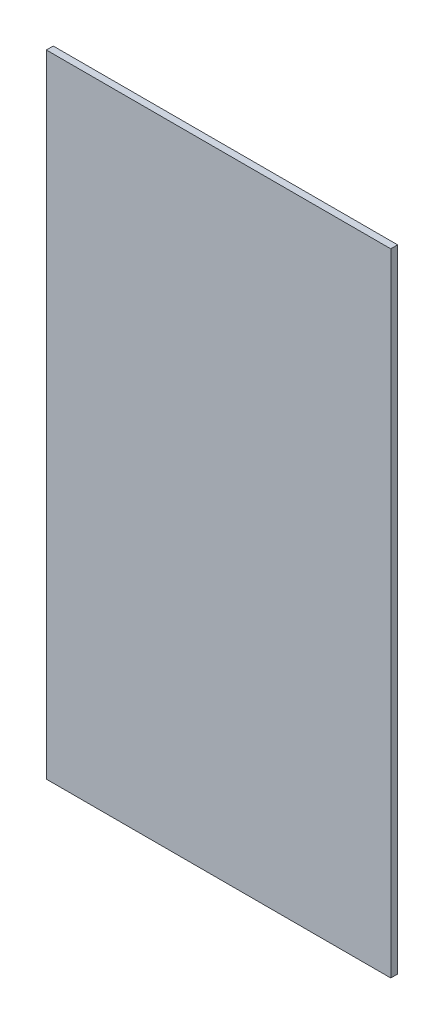
ISO-10303-21;
HEADER;
FILE_DESCRIPTION(('STEP AP214'),'2;1');
FILE_NAME('part.step','',(''),(''),'','','');
FILE_SCHEMA(('AUTOMOTIVE_DESIGN { 1 0 10303 214 1 1 1 1 }'));
ENDSEC;
DATA;
#1=APPLICATION_CONTEXT('core data for automotive mechanical design processes');
#2=APPLICATION_PROTOCOL_DEFINITION('international standard','automotive_design',2000,#1);
#3=PRODUCT_CONTEXT('',#1,'mechanical');
#4=PRODUCT('Part','Part','',(#3));
#5=PRODUCT_RELATED_PRODUCT_CATEGORY('part','',(#4));
#6=PRODUCT_DEFINITION_FORMATION('','',#4);
#7=PRODUCT_DEFINITION_CONTEXT('part definition',#1,'design');
#8=PRODUCT_DEFINITION('design','',#6,#7);
#9=PRODUCT_DEFINITION_SHAPE('','',#8);
#10=(LENGTH_UNIT() NAMED_UNIT(*) SI_UNIT(.MILLI.,.METRE.));
#11=(NAMED_UNIT(*) PLANE_ANGLE_UNIT() SI_UNIT($,.RADIAN.));
#12=(NAMED_UNIT(*) SI_UNIT($,.STERADIAN.) SOLID_ANGLE_UNIT());
#13=UNCERTAINTY_MEASURE_WITH_UNIT(LENGTH_MEASURE(1.E-05),#10,'distance_accuracy_value','');
#14=(GEOMETRIC_REPRESENTATION_CONTEXT(3) GLOBAL_UNCERTAINTY_ASSIGNED_CONTEXT((#13)) GLOBAL_UNIT_ASSIGNED_CONTEXT((#10,
#11,#12)) REPRESENTATION_CONTEXT('',''));
#15=CARTESIAN_POINT('',(0.,0.,0.));
#16=DIRECTION('',(0.,0.,1.));
#17=DIRECTION('',(1.,0.,0.));
#18=AXIS2_PLACEMENT_3D('',#15,#16,#17);
#19=CARTESIAN_POINT('',(0.5,0.,0.));
#20=DIRECTION('',(0.,0.,1.));
#21=DIRECTION('',(1.,0.,0.));
#22=AXIS2_PLACEMENT_3D('',#19,#20,#21);
#23=PLANE('',#22);
#24=DIRECTION('',(1.,0.,0.));
#25=VECTOR('',#24,1.);
#26=CARTESIAN_POINT('',(3.,4.584,0.));
#27=LINE('',#26,#25);
#28=CARTESIAN_POINT('',(3.,4.584,0.));
#29=VERTEX_POINT('',#28);
#30=CARTESIAN_POINT('',(-2.,4.584,0.));
#31=VERTEX_POINT('',#30);
#32=EDGE_CURVE('E79',#29,#31,#27,.F.);
#33=ORIENTED_EDGE('',*,*,#32,.F.);
#34=DIRECTION('',(0.,1.,0.));
#35=VECTOR('',#34,1.);
#36=CARTESIAN_POINT('',(3.,-4.584,0.));
#37=LINE('',#36,#35);
#38=CARTESIAN_POINT('',(3.,-4.584,0.));
#39=VERTEX_POINT('',#38);
#40=EDGE_CURVE('E55',#39,#29,#37,.T.);
#41=ORIENTED_EDGE('',*,*,#40,.F.);
#42=DIRECTION('',(1.,0.,0.));
#43=VECTOR('',#42,1.);
#44=CARTESIAN_POINT('',(-2.,-4.584,0.));
#45=LINE('',#44,#43);
#46=CARTESIAN_POINT('',(-2.,-4.584,0.));
#47=VERTEX_POINT('',#46);
#48=EDGE_CURVE('E57',#47,#39,#45,.T.);
#49=ORIENTED_EDGE('',*,*,#48,.F.);
#50=DIRECTION('',(0.,-1.,0.));
#51=VECTOR('',#50,1.);
#52=CARTESIAN_POINT('',(-2.,4.584,0.));
#53=LINE('',#52,#51);
#54=EDGE_CURVE('E20',#31,#47,#53,.T.);
#55=ORIENTED_EDGE('',*,*,#54,.F.);
#56=EDGE_LOOP('',(#33,#41,#49,#55));
#57=FACE_BOUND('',#56,.T.);
#58=ADVANCED_FACE('F17',(#57),#23,.F.);
#59=CARTESIAN_POINT('',(-2.,4.584,0.));
#60=DIRECTION('',(-1.,0.,0.));
#61=DIRECTION('',(0.,-1.,0.));
#62=AXIS2_PLACEMENT_3D('',#59,#60,#61);
#63=PLANE('',#62);
#64=DIRECTION('',(0.,1.,0.));
#65=VECTOR('',#64,1.);
#66=CARTESIAN_POINT('',(-2.,0.,0.1));
#67=LINE('',#66,#65);
#68=CARTESIAN_POINT('',(-2.,4.584,0.1));
#69=VERTEX_POINT('',#68);
#70=CARTESIAN_POINT('',(-2.,-4.584,0.1));
#71=VERTEX_POINT('',#70);
#72=EDGE_CURVE('E83',#69,#71,#67,.F.);
#73=ORIENTED_EDGE('',*,*,#72,.F.);
#74=DIRECTION('',(0.,0.,1.));
#75=VECTOR('',#74,1.);
#76=CARTESIAN_POINT('',(-2.,4.584,0.));
#77=LINE('',#76,#75);
#78=EDGE_CURVE('E68',#31,#69,#77,.T.);
#79=ORIENTED_EDGE('',*,*,#78,.F.);
#80=ORIENTED_EDGE('',*,*,#54,.T.);
#81=DIRECTION('',(0.,0.,-1.));
#82=VECTOR('',#81,1.);
#83=CARTESIAN_POINT('',(-2.,-4.584,0.));
#84=LINE('',#83,#82);
#85=EDGE_CURVE('E63',#71,#47,#84,.T.);
#86=ORIENTED_EDGE('',*,*,#85,.F.);
#87=EDGE_LOOP('',(#73,#79,#80,#86));
#88=FACE_BOUND('',#87,.T.);
#89=ADVANCED_FACE('F65',(#88),#63,.T.);
#90=CARTESIAN_POINT('',(-2.,-4.584,0.));
#91=DIRECTION('',(0.,-1.,0.));
#92=DIRECTION('',(0.,0.,-1.));
#93=AXIS2_PLACEMENT_3D('',#90,#91,#92);
#94=PLANE('',#93);
#95=DIRECTION('',(1.,0.,0.));
#96=VECTOR('',#95,1.);
#97=CARTESIAN_POINT('',(0.5,-4.584,0.1));
#98=LINE('',#97,#96);
#99=CARTESIAN_POINT('',(3.,-4.584,0.1));
#100=VERTEX_POINT('',#99);
#101=EDGE_CURVE('E72',#71,#100,#98,.T.);
#102=ORIENTED_EDGE('',*,*,#101,.F.);
#103=ORIENTED_EDGE('',*,*,#85,.T.);
#104=ORIENTED_EDGE('',*,*,#48,.T.);
#105=DIRECTION('',(0.,0.,1.));
#106=VECTOR('',#105,1.);
#107=CARTESIAN_POINT('',(3.,-4.584,0.));
#108=LINE('',#107,#106);
#109=EDGE_CURVE('E75',#100,#39,#108,.F.);
#110=ORIENTED_EDGE('',*,*,#109,.F.);
#111=EDGE_LOOP('',(#102,#103,#104,#110));
#112=FACE_BOUND('',#111,.T.);
#113=ADVANCED_FACE('F70',(#112),#94,.T.);
#114=CARTESIAN_POINT('',(3.,-4.584,0.));
#115=DIRECTION('',(1.,0.,0.));
#116=DIRECTION('',(0.,1.,0.));
#117=AXIS2_PLACEMENT_3D('',#114,#115,#116);
#118=PLANE('',#117);
#119=DIRECTION('',(0.,1.,0.));
#120=VECTOR('',#119,1.);
#121=CARTESIAN_POINT('',(3.,0.,0.1));
#122=LINE('',#121,#120);
#123=CARTESIAN_POINT('',(3.,4.584,0.1));
#124=VERTEX_POINT('',#123);
#125=EDGE_CURVE('E26',#100,#124,#122,.T.);
#126=ORIENTED_EDGE('',*,*,#125,.F.);
#127=ORIENTED_EDGE('',*,*,#109,.T.);
#128=ORIENTED_EDGE('',*,*,#40,.T.);
#129=DIRECTION('',(0.,0.,1.));
#130=VECTOR('',#129,1.);
#131=CARTESIAN_POINT('',(3.,4.584,0.));
#132=LINE('',#131,#130);
#133=EDGE_CURVE('E35',#124,#29,#132,.F.);
#134=ORIENTED_EDGE('',*,*,#133,.F.);
#135=EDGE_LOOP('',(#126,#127,#128,#134));
#136=FACE_BOUND('',#135,.T.);
#137=ADVANCED_FACE('F89',(#136),#118,.T.);
#138=CARTESIAN_POINT('',(3.,4.584,0.));
#139=DIRECTION('',(0.,1.,0.));
#140=DIRECTION('',(0.,0.,1.));
#141=AXIS2_PLACEMENT_3D('',#138,#139,#140);
#142=PLANE('',#141);
#143=DIRECTION('',(1.,0.,0.));
#144=VECTOR('',#143,1.);
#145=CARTESIAN_POINT('',(0.5,4.584,0.1));
#146=LINE('',#145,#144);
#147=EDGE_CURVE('E11',#124,#69,#146,.F.);
#148=ORIENTED_EDGE('',*,*,#147,.F.);
#149=ORIENTED_EDGE('',*,*,#133,.T.);
#150=ORIENTED_EDGE('',*,*,#32,.T.);
#151=ORIENTED_EDGE('',*,*,#78,.T.);
#152=EDGE_LOOP('',(#148,#149,#150,#151));
#153=FACE_BOUND('',#152,.T.);
#154=ADVANCED_FACE('F91',(#153),#142,.T.);
#155=CARTESIAN_POINT('',(0.5,0.,0.1));
#156=DIRECTION('',(0.,0.,1.));
#157=DIRECTION('',(1.,0.,0.));
#158=AXIS2_PLACEMENT_3D('',#155,#156,#157);
#159=PLANE('',#158);
#160=ORIENTED_EDGE('',*,*,#125,.T.);
#161=ORIENTED_EDGE('',*,*,#147,.T.);
#162=ORIENTED_EDGE('',*,*,#72,.T.);
#163=ORIENTED_EDGE('',*,*,#101,.T.);
#164=EDGE_LOOP('',(#160,#161,#162,#163));
#165=FACE_BOUND('',#164,.T.);
#166=ADVANCED_FACE('F88',(#165),#159,.T.);
#167=CLOSED_SHELL('',(#58,#89,#113,#137,#154,#166));
#168=MANIFOLD_SOLID_BREP('B1',#167);
#169=ADVANCED_BREP_SHAPE_REPRESENTATION('',(#18,#168),#14);
#170=SHAPE_DEFINITION_REPRESENTATION(#9,#169);
ENDSEC;
END-ISO-10303-21;
